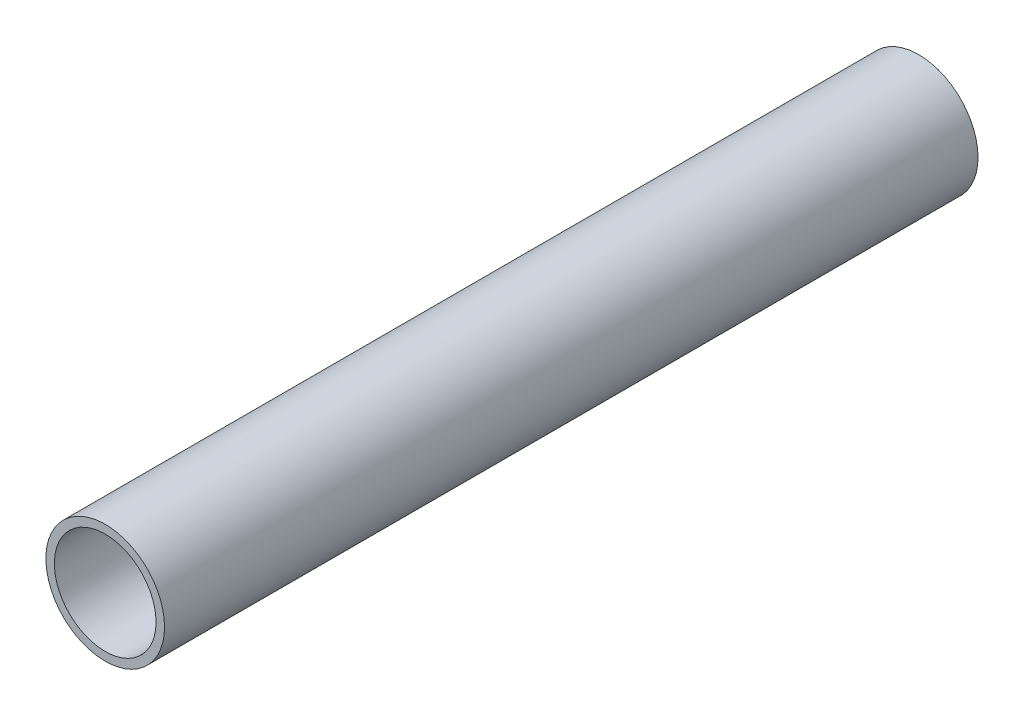
ISO-10303-21;
HEADER;
FILE_DESCRIPTION(('STEP AP214'),'2;1');
FILE_NAME('part.step','',(''),(''),'','','');
FILE_SCHEMA(('AUTOMOTIVE_DESIGN { 1 0 10303 214 1 1 1 1 }'));
ENDSEC;
DATA;
#1=APPLICATION_CONTEXT('core data for automotive mechanical design processes');
#2=APPLICATION_PROTOCOL_DEFINITION('international standard','automotive_design',2000,#1);
#3=PRODUCT_CONTEXT('',#1,'mechanical');
#4=PRODUCT('Part','Part','',(#3));
#5=PRODUCT_RELATED_PRODUCT_CATEGORY('part','',(#4));
#6=PRODUCT_DEFINITION_FORMATION('','',#4);
#7=PRODUCT_DEFINITION_CONTEXT('part definition',#1,'design');
#8=PRODUCT_DEFINITION('design','',#6,#7);
#9=PRODUCT_DEFINITION_SHAPE('','',#8);
#10=(LENGTH_UNIT() NAMED_UNIT(*) SI_UNIT(.MILLI.,.METRE.));
#11=(NAMED_UNIT(*) PLANE_ANGLE_UNIT() SI_UNIT($,.RADIAN.));
#12=(NAMED_UNIT(*) SI_UNIT($,.STERADIAN.) SOLID_ANGLE_UNIT());
#13=UNCERTAINTY_MEASURE_WITH_UNIT(LENGTH_MEASURE(1.E-05),#10,'distance_accuracy_value','');
#14=(GEOMETRIC_REPRESENTATION_CONTEXT(3) GLOBAL_UNCERTAINTY_ASSIGNED_CONTEXT((#13)) GLOBAL_UNIT_ASSIGNED_CONTEXT((#10,
#11,#12)) REPRESENTATION_CONTEXT('',''));
#15=CARTESIAN_POINT('',(0.,0.,0.));
#16=DIRECTION('',(0.,0.,1.));
#17=DIRECTION('',(1.,0.,0.));
#18=AXIS2_PLACEMENT_3D('',#15,#16,#17);
#19=CARTESIAN_POINT('',(0.,0.,-152.4));
#20=DIRECTION('',(0.,0.,1.));
#21=DIRECTION('',(1.,0.,0.));
#22=AXIS2_PLACEMENT_3D('',#19,#20,#21);
#23=CYLINDRICAL_SURFACE('',#22,11.1125);
#24=CARTESIAN_POINT('',(0.,0.,-152.4));
#25=DIRECTION('',(0.,0.,1.));
#26=DIRECTION('',(1.,0.,0.));
#27=AXIS2_PLACEMENT_3D('',#24,#25,#26);
#28=CIRCLE('',#27,11.1125);
#29=CARTESIAN_POINT('',(11.1125,0.,-152.4));
#30=VERTEX_POINT('',#29);
#31=EDGE_CURVE('E12',#30,#30,#28,.T.);
#32=ORIENTED_EDGE('',*,*,#31,.T.);
#33=EDGE_LOOP('',(#32));
#34=FACE_BOUND('',#33,.T.);
#35=CARTESIAN_POINT('',(0.,0.,0.));
#36=DIRECTION('',(0.,0.,1.));
#37=DIRECTION('',(1.,0.,0.));
#38=AXIS2_PLACEMENT_3D('',#35,#36,#37);
#39=CIRCLE('',#38,11.1125);
#40=CARTESIAN_POINT('',(11.1125,0.,0.));
#41=VERTEX_POINT('',#40);
#42=EDGE_CURVE('E49',#41,#41,#39,.T.);
#43=ORIENTED_EDGE('',*,*,#42,.F.);
#44=EDGE_LOOP('',(#43));
#45=FACE_BOUND('',#44,.T.);
#46=ADVANCED_FACE('F46',(#34,#45),#23,.T.);
#47=CARTESIAN_POINT('',(0.,0.,-152.4));
#48=DIRECTION('',(0.,0.,1.));
#49=DIRECTION('',(1.,0.,0.));
#50=AXIS2_PLACEMENT_3D('',#47,#48,#49);
#51=PLANE('',#50);
#52=CARTESIAN_POINT('',(0.,0.,-152.4));
#53=DIRECTION('',(0.,0.,1.));
#54=DIRECTION('',(1.,0.,0.));
#55=AXIS2_PLACEMENT_3D('',#52,#53,#54);
#56=CIRCLE('',#55,9.525);
#57=CARTESIAN_POINT('',(9.525,0.,-152.4));
#58=VERTEX_POINT('',#57);
#59=EDGE_CURVE('E56',#58,#58,#56,.T.);
#60=ORIENTED_EDGE('',*,*,#59,.T.);
#61=EDGE_LOOP('',(#60));
#62=FACE_BOUND('',#61,.T.);
#63=ORIENTED_EDGE('',*,*,#31,.F.);
#64=EDGE_LOOP('',(#63));
#65=FACE_BOUND('',#64,.T.);
#66=ADVANCED_FACE('F64',(#62,#65),#51,.F.);
#67=CARTESIAN_POINT('',(0.,0.,0.));
#68=DIRECTION('',(0.,0.,1.));
#69=DIRECTION('',(1.,0.,0.));
#70=AXIS2_PLACEMENT_3D('',#67,#68,#69);
#71=PLANE('',#70);
#72=CARTESIAN_POINT('',(0.,0.,0.));
#73=DIRECTION('',(0.,0.,1.));
#74=DIRECTION('',(1.,0.,0.));
#75=AXIS2_PLACEMENT_3D('',#72,#73,#74);
#76=CIRCLE('',#75,9.525);
#77=CARTESIAN_POINT('',(9.525,0.,0.));
#78=VERTEX_POINT('',#77);
#79=EDGE_CURVE('E58',#78,#78,#76,.T.);
#80=ORIENTED_EDGE('',*,*,#79,.F.);
#81=EDGE_LOOP('',(#80));
#82=FACE_BOUND('',#81,.T.);
#83=ORIENTED_EDGE('',*,*,#42,.T.);
#84=EDGE_LOOP('',(#83));
#85=FACE_BOUND('',#84,.T.);
#86=ADVANCED_FACE('F70',(#82,#85),#71,.T.);
#87=CARTESIAN_POINT('',(0.,0.,-152.4));
#88=DIRECTION('',(0.,0.,1.));
#89=DIRECTION('',(1.,0.,0.));
#90=AXIS2_PLACEMENT_3D('',#87,#88,#89);
#91=CYLINDRICAL_SURFACE('',#90,9.525);
#92=ORIENTED_EDGE('',*,*,#59,.F.);
#93=EDGE_LOOP('',(#92));
#94=FACE_BOUND('',#93,.T.);
#95=ORIENTED_EDGE('',*,*,#79,.T.);
#96=EDGE_LOOP('',(#95));
#97=FACE_BOUND('',#96,.T.);
#98=ADVANCED_FACE('F67',(#94,#97),#91,.F.);
#99=CLOSED_SHELL('',(#46,#66,#86,#98));
#100=MANIFOLD_SOLID_BREP('B2',#99);
#101=ADVANCED_BREP_SHAPE_REPRESENTATION('',(#18,#100),#14);
#102=SHAPE_DEFINITION_REPRESENTATION(#9,#101);
ENDSEC;
END-ISO-10303-21;
